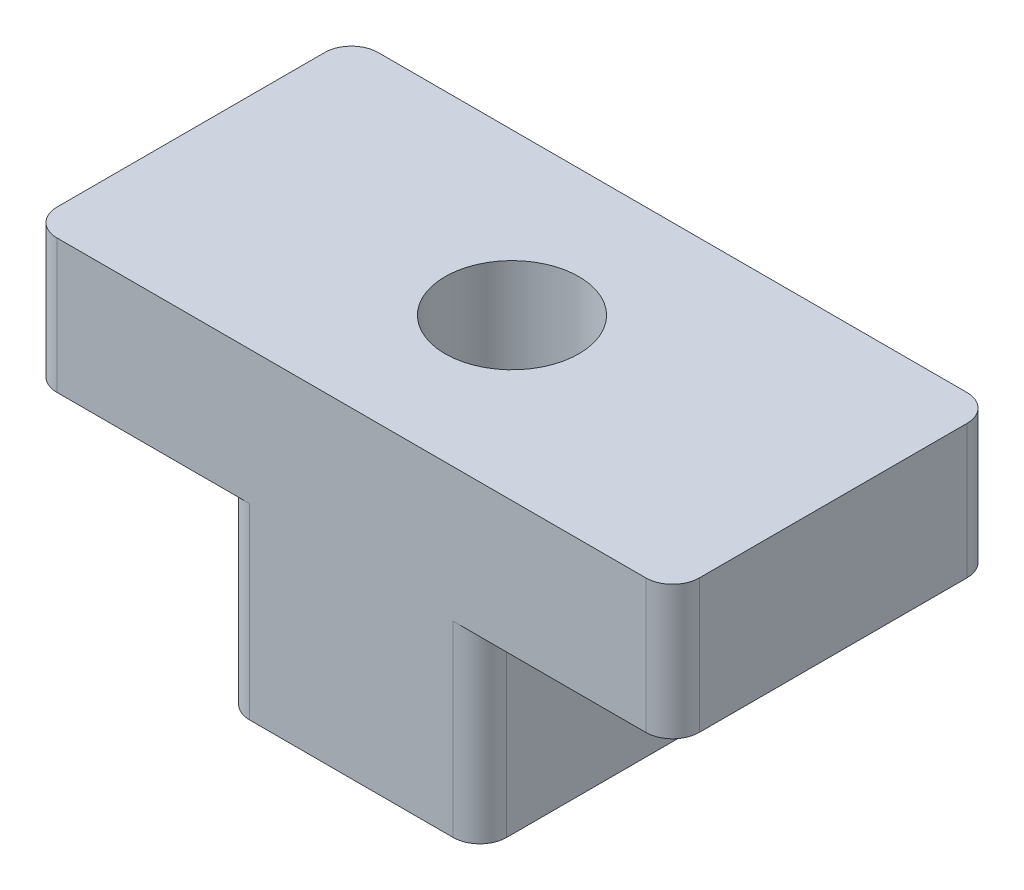
ISO-10303-21;
HEADER;
FILE_DESCRIPTION(('STEP AP214'),'2;1');
FILE_NAME('part.step','',(''),(''),'','','');
FILE_SCHEMA(('AUTOMOTIVE_DESIGN { 1 0 10303 214 1 1 1 1 }'));
ENDSEC;
DATA;
#1=APPLICATION_CONTEXT('core data for automotive mechanical design processes');
#2=APPLICATION_PROTOCOL_DEFINITION('international standard','automotive_design',2000,#1);
#3=PRODUCT_CONTEXT('',#1,'mechanical');
#4=PRODUCT('Part','Part','',(#3));
#5=PRODUCT_RELATED_PRODUCT_CATEGORY('part','',(#4));
#6=PRODUCT_DEFINITION_FORMATION('','',#4);
#7=PRODUCT_DEFINITION_CONTEXT('part definition',#1,'design');
#8=PRODUCT_DEFINITION('design','',#6,#7);
#9=PRODUCT_DEFINITION_SHAPE('','',#8);
#10=(LENGTH_UNIT() NAMED_UNIT(*) SI_UNIT(.MILLI.,.METRE.));
#11=(NAMED_UNIT(*) PLANE_ANGLE_UNIT() SI_UNIT($,.RADIAN.));
#12=(NAMED_UNIT(*) SI_UNIT($,.STERADIAN.) SOLID_ANGLE_UNIT());
#13=UNCERTAINTY_MEASURE_WITH_UNIT(LENGTH_MEASURE(1.E-05),#10,'distance_accuracy_value','');
#14=(GEOMETRIC_REPRESENTATION_CONTEXT(3) GLOBAL_UNCERTAINTY_ASSIGNED_CONTEXT((#13)) GLOBAL_UNIT_ASSIGNED_CONTEXT((#10,
#11,#12)) REPRESENTATION_CONTEXT('',''));
#15=CARTESIAN_POINT('',(0.,0.,0.));
#16=DIRECTION('',(0.,0.,1.));
#17=DIRECTION('',(1.,0.,0.));
#18=AXIS2_PLACEMENT_3D('',#15,#16,#17);
#19=CARTESIAN_POINT('',(6.,0.,3.));
#20=DIRECTION('',(-1.,0.,0.));
#21=DIRECTION('',(0.,0.,1.));
#22=AXIS2_PLACEMENT_3D('',#19,#20,#21);
#23=PLANE('',#22);
#24=DIRECTION('',(0.,0.,-1.));
#25=VECTOR('',#24,1.);
#26=CARTESIAN_POINT('',(6.,0.,3.));
#27=LINE('',#26,#25);
#28=CARTESIAN_POINT('',(6.,0.,2.5));
#29=VERTEX_POINT('',#28);
#30=CARTESIAN_POINT('',(6.,0.,-2.5));
#31=VERTEX_POINT('',#30);
#32=EDGE_CURVE('E184',#29,#31,#27,.T.);
#33=ORIENTED_EDGE('',*,*,#32,.T.);
#34=DIRECTION('',(0.,1.,0.));
#35=VECTOR('',#34,1.);
#36=CARTESIAN_POINT('',(6.,2.5,-2.5));
#37=LINE('',#36,#35);
#38=CARTESIAN_POINT('',(6.,2.5,-2.5));
#39=VERTEX_POINT('',#38);
#40=EDGE_CURVE('E274',#31,#39,#37,.T.);
#41=ORIENTED_EDGE('',*,*,#40,.T.);
#42=DIRECTION('',(0.,0.,-1.));
#43=VECTOR('',#42,1.);
#44=CARTESIAN_POINT('',(6.,2.5,3.));
#45=LINE('',#44,#43);
#46=CARTESIAN_POINT('',(6.,2.5,2.5));
#47=VERTEX_POINT('',#46);
#48=EDGE_CURVE('E190',#47,#39,#45,.T.);
#49=ORIENTED_EDGE('',*,*,#48,.F.);
#50=DIRECTION('',(0.,1.,0.));
#51=VECTOR('',#50,1.);
#52=CARTESIAN_POINT('',(6.,0.,2.5));
#53=LINE('',#52,#51);
#54=EDGE_CURVE('E70',#47,#29,#53,.F.);
#55=ORIENTED_EDGE('',*,*,#54,.T.);
#56=EDGE_LOOP('',(#33,#41,#49,#55));
#57=FACE_BOUND('',#56,.T.);
#58=ADVANCED_FACE('F47',(#57),#23,.F.);
#59=CARTESIAN_POINT('',(-6.,2.5,3.));
#60=DIRECTION('',(0.,-1.,0.));
#61=DIRECTION('',(0.,0.,-1.));
#62=AXIS2_PLACEMENT_3D('',#59,#60,#61);
#63=PLANE('',#62);
#64=CARTESIAN_POINT('',(0.,2.5,0.));
#65=DIRECTION('',(0.,1.,0.));
#66=DIRECTION('',(0.,0.,1.));
#67=AXIS2_PLACEMENT_3D('',#64,#65,#66);
#68=CIRCLE('',#67,1.25);
#69=CARTESIAN_POINT('',(0.,2.5,1.25));
#70=VERTEX_POINT('',#69);
#71=EDGE_CURVE('E366',#70,#70,#68,.T.);
#72=ORIENTED_EDGE('',*,*,#71,.F.);
#73=EDGE_LOOP('',(#72));
#74=FACE_BOUND('',#73,.T.);
#75=DIRECTION('',(0.,0.,-1.));
#76=VECTOR('',#75,1.);
#77=CARTESIAN_POINT('',(-6.,2.5,3.));
#78=LINE('',#77,#76);
#79=CARTESIAN_POINT('',(-6.,2.5,2.5));
#80=VERTEX_POINT('',#79);
#81=CARTESIAN_POINT('',(-6.,2.5,-2.5));
#82=VERTEX_POINT('',#81);
#83=EDGE_CURVE('E199',#80,#82,#78,.T.);
#84=ORIENTED_EDGE('',*,*,#83,.F.);
#85=CARTESIAN_POINT('',(-5.5,2.5,2.5));
#86=DIRECTION('',(0.,-1.,0.));
#87=DIRECTION('',(0.,0.,-1.));
#88=AXIS2_PLACEMENT_3D('',#85,#86,#87);
#89=CIRCLE('',#88,0.5);
#90=CARTESIAN_POINT('',(-5.5,2.5,3.));
#91=VERTEX_POINT('',#90);
#92=EDGE_CURVE('E269',#80,#91,#89,.F.);
#93=ORIENTED_EDGE('',*,*,#92,.T.);
#94=DIRECTION('',(-1.,0.,0.));
#95=VECTOR('',#94,1.);
#96=CARTESIAN_POINT('',(-6.,2.5,3.));
#97=LINE('',#96,#95);
#98=CARTESIAN_POINT('',(5.5,2.5,3.));
#99=VERTEX_POINT('',#98);
#100=EDGE_CURVE('E327',#99,#91,#97,.T.);
#101=ORIENTED_EDGE('',*,*,#100,.F.);
#102=CARTESIAN_POINT('',(5.5,2.5,2.5));
#103=DIRECTION('',(0.,-1.,0.));
#104=DIRECTION('',(0.,0.,-1.));
#105=AXIS2_PLACEMENT_3D('',#102,#103,#104);
#106=CIRCLE('',#105,0.5);
#107=EDGE_CURVE('E260',#99,#47,#106,.F.);
#108=ORIENTED_EDGE('',*,*,#107,.T.);
#109=ORIENTED_EDGE('',*,*,#48,.T.);
#110=CARTESIAN_POINT('',(5.5,2.5,-2.5));
#111=DIRECTION('',(0.,-1.,0.));
#112=DIRECTION('',(0.,0.,-1.));
#113=AXIS2_PLACEMENT_3D('',#110,#111,#112);
#114=CIRCLE('',#113,0.5);
#115=CARTESIAN_POINT('',(5.5,2.5,-3.));
#116=VERTEX_POINT('',#115);
#117=EDGE_CURVE('E263',#39,#116,#114,.F.);
#118=ORIENTED_EDGE('',*,*,#117,.T.);
#119=DIRECTION('',(-1.,0.,0.));
#120=VECTOR('',#119,1.);
#121=CARTESIAN_POINT('',(-6.,2.5,-3.));
#122=LINE('',#121,#120);
#123=CARTESIAN_POINT('',(-5.5,2.5,-3.));
#124=VERTEX_POINT('',#123);
#125=EDGE_CURVE('E330',#116,#124,#122,.T.);
#126=ORIENTED_EDGE('',*,*,#125,.T.);
#127=CARTESIAN_POINT('',(-5.5,2.5,-2.5));
#128=DIRECTION('',(0.,-1.,0.));
#129=DIRECTION('',(0.,0.,-1.));
#130=AXIS2_PLACEMENT_3D('',#127,#128,#129);
#131=CIRCLE('',#130,0.5);
#132=EDGE_CURVE('E266',#124,#82,#131,.F.);
#133=ORIENTED_EDGE('',*,*,#132,.T.);
#134=EDGE_LOOP('',(#84,#93,#101,#108,#109,#118,#126,#133));
#135=FACE_BOUND('',#134,.T.);
#136=ADVANCED_FACE('F360',(#74,#135),#63,.F.);
#137=CARTESIAN_POINT('',(-6.,0.,3.));
#138=DIRECTION('',(1.,0.,0.));
#139=DIRECTION('',(0.,0.,-1.));
#140=AXIS2_PLACEMENT_3D('',#137,#138,#139);
#141=PLANE('',#140);
#142=DIRECTION('',(0.,0.,-1.));
#143=VECTOR('',#142,1.);
#144=CARTESIAN_POINT('',(-6.,0.,3.));
#145=LINE('',#144,#143);
#146=CARTESIAN_POINT('',(-6.,0.,2.5));
#147=VERTEX_POINT('',#146);
#148=CARTESIAN_POINT('',(-6.,0.,-2.5));
#149=VERTEX_POINT('',#148);
#150=EDGE_CURVE('E308',#147,#149,#145,.T.);
#151=ORIENTED_EDGE('',*,*,#150,.F.);
#152=DIRECTION('',(0.,-1.,0.));
#153=VECTOR('',#152,1.);
#154=CARTESIAN_POINT('',(-6.,0.,2.5));
#155=LINE('',#154,#153);
#156=EDGE_CURVE('E257',#147,#80,#155,.F.);
#157=ORIENTED_EDGE('',*,*,#156,.T.);
#158=ORIENTED_EDGE('',*,*,#83,.T.);
#159=DIRECTION('',(0.,-1.,0.));
#160=VECTOR('',#159,1.);
#161=CARTESIAN_POINT('',(-6.,0.,-2.5));
#162=LINE('',#161,#160);
#163=EDGE_CURVE('E254',#82,#149,#162,.T.);
#164=ORIENTED_EDGE('',*,*,#163,.T.);
#165=EDGE_LOOP('',(#151,#157,#158,#164));
#166=FACE_BOUND('',#165,.T.);
#167=ADVANCED_FACE('F349',(#166),#141,.F.);
#168=CARTESIAN_POINT('',(-6.,0.,3.));
#169=DIRECTION('',(0.,1.,0.));
#170=DIRECTION('',(-1.,0.,0.));
#171=AXIS2_PLACEMENT_3D('',#168,#169,#170);
#172=PLANE('',#171);
#173=DIRECTION('',(1.,0.,0.));
#174=VECTOR('',#173,1.);
#175=CARTESIAN_POINT('',(-6.,0.,3.));
#176=LINE('',#175,#174);
#177=CARTESIAN_POINT('',(-5.5,0.,3.));
#178=VERTEX_POINT('',#177);
#179=CARTESIAN_POINT('',(-1.9,0.,3.));
#180=VERTEX_POINT('',#179);
#181=EDGE_CURVE('E374',#178,#180,#176,.T.);
#182=ORIENTED_EDGE('',*,*,#181,.F.);
#183=CARTESIAN_POINT('',(-5.5,0.,2.5));
#184=DIRECTION('',(0.,1.,0.));
#185=DIRECTION('',(-1.,0.,0.));
#186=AXIS2_PLACEMENT_3D('',#183,#184,#185);
#187=CIRCLE('',#186,0.5);
#188=EDGE_CURVE('E251',#178,#147,#187,.F.);
#189=ORIENTED_EDGE('',*,*,#188,.T.);
#190=ORIENTED_EDGE('',*,*,#150,.T.);
#191=CARTESIAN_POINT('',(-5.5,0.,-2.5));
#192=DIRECTION('',(0.,1.,0.));
#193=DIRECTION('',(-1.,0.,0.));
#194=AXIS2_PLACEMENT_3D('',#191,#192,#193);
#195=CIRCLE('',#194,0.5);
#196=CARTESIAN_POINT('',(-5.5,0.,-3.));
#197=VERTEX_POINT('',#196);
#198=EDGE_CURVE('E248',#149,#197,#195,.F.);
#199=ORIENTED_EDGE('',*,*,#198,.T.);
#200=DIRECTION('',(1.,0.,0.));
#201=VECTOR('',#200,1.);
#202=CARTESIAN_POINT('',(-6.,0.,-3.));
#203=LINE('',#202,#201);
#204=CARTESIAN_POINT('',(-1.9,0.,-3.));
#205=VERTEX_POINT('',#204);
#206=EDGE_CURVE('E298',#197,#205,#203,.T.);
#207=ORIENTED_EDGE('',*,*,#206,.T.);
#208=CARTESIAN_POINT('',(-1.9,0.,-2.5));
#209=DIRECTION('',(0.,1.,0.));
#210=DIRECTION('',(-1.,0.,0.));
#211=AXIS2_PLACEMENT_3D('',#208,#209,#210);
#212=CIRCLE('',#211,0.5);
#213=CARTESIAN_POINT('',(-2.4,0.,-2.5));
#214=VERTEX_POINT('',#213);
#215=EDGE_CURVE('E173',#205,#214,#212,.T.);
#216=ORIENTED_EDGE('',*,*,#215,.T.);
#217=DIRECTION('',(0.,0.,-1.));
#218=VECTOR('',#217,1.);
#219=CARTESIAN_POINT('',(-2.4,0.,3.));
#220=LINE('',#219,#218);
#221=CARTESIAN_POINT('',(-2.4,0.,2.5));
#222=VERTEX_POINT('',#221);
#223=EDGE_CURVE('E295',#222,#214,#220,.T.);
#224=ORIENTED_EDGE('',*,*,#223,.F.);
#225=CARTESIAN_POINT('',(-1.9,0.,2.5));
#226=DIRECTION('',(0.,1.,0.));
#227=DIRECTION('',(-1.,0.,0.));
#228=AXIS2_PLACEMENT_3D('',#225,#226,#227);
#229=CIRCLE('',#228,0.5);
#230=EDGE_CURVE('E11',#222,#180,#229,.T.);
#231=ORIENTED_EDGE('',*,*,#230,.T.);
#232=EDGE_LOOP('',(#182,#189,#190,#199,#207,#216,#224,#231));
#233=FACE_BOUND('',#232,.T.);
#234=ADVANCED_FACE('F294',(#233),#172,.F.);
#235=CARTESIAN_POINT('',(-2.4,0.,3.));
#236=DIRECTION('',(1.,0.,0.));
#237=DIRECTION('',(0.,1.,0.));
#238=AXIS2_PLACEMENT_3D('',#235,#236,#237);
#239=PLANE('',#238);
#240=ORIENTED_EDGE('',*,*,#223,.T.);
#241=DIRECTION('',(0.,-1.,0.));
#242=VECTOR('',#241,1.);
#243=CARTESIAN_POINT('',(-2.4,-3.5,-2.5));
#244=LINE('',#243,#242);
#245=CARTESIAN_POINT('',(-2.4,-3.5,-2.5));
#246=VERTEX_POINT('',#245);
#247=EDGE_CURVE('E229',#214,#246,#244,.T.);
#248=ORIENTED_EDGE('',*,*,#247,.T.);
#249=DIRECTION('',(0.,0.,-1.));
#250=VECTOR('',#249,1.);
#251=CARTESIAN_POINT('',(-2.4,-3.5,3.));
#252=LINE('',#251,#250);
#253=CARTESIAN_POINT('',(-2.4,-3.5,2.5));
#254=VERTEX_POINT('',#253);
#255=EDGE_CURVE('E309',#254,#246,#252,.T.);
#256=ORIENTED_EDGE('',*,*,#255,.F.);
#257=DIRECTION('',(0.,-1.,0.));
#258=VECTOR('',#257,1.);
#259=CARTESIAN_POINT('',(-2.4,0.,2.5));
#260=LINE('',#259,#258);
#261=EDGE_CURVE('E226',#254,#222,#260,.F.);
#262=ORIENTED_EDGE('',*,*,#261,.T.);
#263=EDGE_LOOP('',(#240,#248,#256,#262));
#264=FACE_BOUND('',#263,.T.);
#265=ADVANCED_FACE('F303',(#264),#239,.F.);
#266=CARTESIAN_POINT('',(-2.4,-3.5,3.));
#267=DIRECTION('',(0.,1.,0.));
#268=DIRECTION('',(-1.,0.,0.));
#269=AXIS2_PLACEMENT_3D('',#266,#267,#268);
#270=PLANE('',#269);
#271=CARTESIAN_POINT('',(0.,-3.5,0.));
#272=DIRECTION('',(0.,1.,0.));
#273=DIRECTION('',(0.,0.,1.));
#274=AXIS2_PLACEMENT_3D('',#271,#272,#273);
#275=CIRCLE('',#274,1.25);
#276=CARTESIAN_POINT('',(0.,-3.5,1.25));
#277=VERTEX_POINT('',#276);
#278=EDGE_CURVE('E362',#277,#277,#275,.T.);
#279=ORIENTED_EDGE('',*,*,#278,.T.);
#280=EDGE_LOOP('',(#279));
#281=FACE_BOUND('',#280,.T.);
#282=DIRECTION('',(1.,0.,0.));
#283=VECTOR('',#282,1.);
#284=CARTESIAN_POINT('',(-2.4,-3.5,-3.));
#285=LINE('',#284,#283);
#286=CARTESIAN_POINT('',(-1.9,-3.5,-3.));
#287=VERTEX_POINT('',#286);
#288=CARTESIAN_POINT('',(1.9,-3.5,-3.));
#289=VERTEX_POINT('',#288);
#290=EDGE_CURVE('E316',#287,#289,#285,.T.);
#291=ORIENTED_EDGE('',*,*,#290,.T.);
#292=CARTESIAN_POINT('',(1.9,-3.5,-2.5));
#293=DIRECTION('',(0.,1.,0.));
#294=DIRECTION('',(-1.,0.,0.));
#295=AXIS2_PLACEMENT_3D('',#292,#293,#294);
#296=CIRCLE('',#295,0.5);
#297=CARTESIAN_POINT('',(2.4,-3.5,-2.5));
#298=VERTEX_POINT('',#297);
#299=EDGE_CURVE('E223',#289,#298,#296,.F.);
#300=ORIENTED_EDGE('',*,*,#299,.T.);
#301=DIRECTION('',(0.,0.,-1.));
#302=VECTOR('',#301,1.);
#303=CARTESIAN_POINT('',(2.4,-3.5,3.));
#304=LINE('',#303,#302);
#305=CARTESIAN_POINT('',(2.4,-3.5,2.5));
#306=VERTEX_POINT('',#305);
#307=EDGE_CURVE('E183',#306,#298,#304,.T.);
#308=ORIENTED_EDGE('',*,*,#307,.F.);
#309=CARTESIAN_POINT('',(1.9,-3.5,2.5));
#310=DIRECTION('',(0.,1.,0.));
#311=DIRECTION('',(-1.,0.,0.));
#312=AXIS2_PLACEMENT_3D('',#309,#310,#311);
#313=CIRCLE('',#312,0.5);
#314=CARTESIAN_POINT('',(1.9,-3.5,3.));
#315=VERTEX_POINT('',#314);
#316=EDGE_CURVE('E188',#306,#315,#313,.F.);
#317=ORIENTED_EDGE('',*,*,#316,.T.);
#318=DIRECTION('',(1.,0.,0.));
#319=VECTOR('',#318,1.);
#320=CARTESIAN_POINT('',(-2.4,-3.5,3.));
#321=LINE('',#320,#319);
#322=CARTESIAN_POINT('',(-1.9,-3.5,3.));
#323=VERTEX_POINT('',#322);
#324=EDGE_CURVE('E371',#323,#315,#321,.T.);
#325=ORIENTED_EDGE('',*,*,#324,.F.);
#326=CARTESIAN_POINT('',(-1.9,-3.5,2.5));
#327=DIRECTION('',(0.,1.,0.));
#328=DIRECTION('',(-1.,0.,0.));
#329=AXIS2_PLACEMENT_3D('',#326,#327,#328);
#330=CIRCLE('',#329,0.5);
#331=EDGE_CURVE('E215',#323,#254,#330,.F.);
#332=ORIENTED_EDGE('',*,*,#331,.T.);
#333=ORIENTED_EDGE('',*,*,#255,.T.);
#334=CARTESIAN_POINT('',(-1.9,-3.5,-2.5));
#335=DIRECTION('',(0.,1.,0.));
#336=DIRECTION('',(-1.,0.,0.));
#337=AXIS2_PLACEMENT_3D('',#334,#335,#336);
#338=CIRCLE('',#337,0.5);
#339=EDGE_CURVE('E220',#246,#287,#338,.F.);
#340=ORIENTED_EDGE('',*,*,#339,.T.);
#341=EDGE_LOOP('',(#291,#300,#308,#317,#325,#332,#333,#340));
#342=FACE_BOUND('',#341,.T.);
#343=ADVANCED_FACE('F315',(#281,#342),#270,.F.);
#344=CARTESIAN_POINT('',(2.4,0.,3.));
#345=DIRECTION('',(-1.,0.,0.));
#346=DIRECTION('',(0.,-1.,0.));
#347=AXIS2_PLACEMENT_3D('',#344,#345,#346);
#348=PLANE('',#347);
#349=ORIENTED_EDGE('',*,*,#307,.T.);
#350=DIRECTION('',(0.,1.,0.));
#351=VECTOR('',#350,1.);
#352=CARTESIAN_POINT('',(2.4,0.,-2.5));
#353=LINE('',#352,#351);
#354=CARTESIAN_POINT('',(2.4,0.,-2.5));
#355=VERTEX_POINT('',#354);
#356=EDGE_CURVE('E181',#298,#355,#353,.T.);
#357=ORIENTED_EDGE('',*,*,#356,.T.);
#358=DIRECTION('',(0.,0.,-1.));
#359=VECTOR('',#358,1.);
#360=CARTESIAN_POINT('',(2.4,0.,3.));
#361=LINE('',#360,#359);
#362=CARTESIAN_POINT('',(2.4,0.,2.5));
#363=VERTEX_POINT('',#362);
#364=EDGE_CURVE('E165',#363,#355,#361,.T.);
#365=ORIENTED_EDGE('',*,*,#364,.F.);
#366=DIRECTION('',(0.,1.,0.));
#367=VECTOR('',#366,1.);
#368=CARTESIAN_POINT('',(2.4,0.,2.5));
#369=LINE('',#368,#367);
#370=EDGE_CURVE('E178',#363,#306,#369,.F.);
#371=ORIENTED_EDGE('',*,*,#370,.T.);
#372=EDGE_LOOP('',(#349,#357,#365,#371));
#373=FACE_BOUND('',#372,.T.);
#374=ADVANCED_FACE('F177',(#373),#348,.F.);
#375=CARTESIAN_POINT('',(6.,0.,3.));
#376=DIRECTION('',(0.,1.,0.));
#377=DIRECTION('',(-1.,0.,0.));
#378=AXIS2_PLACEMENT_3D('',#375,#376,#377);
#379=PLANE('',#378);
#380=DIRECTION('',(1.,0.,0.));
#381=VECTOR('',#380,1.);
#382=CARTESIAN_POINT('',(6.,0.,-3.));
#383=LINE('',#382,#381);
#384=CARTESIAN_POINT('',(1.9,0.,-3.));
#385=VERTEX_POINT('',#384);
#386=CARTESIAN_POINT('',(5.5,0.,-3.));
#387=VERTEX_POINT('',#386);
#388=EDGE_CURVE('E322',#385,#387,#383,.T.);
#389=ORIENTED_EDGE('',*,*,#388,.T.);
#390=CARTESIAN_POINT('',(5.5,0.,-2.5));
#391=DIRECTION('',(0.,1.,0.));
#392=DIRECTION('',(-1.,0.,0.));
#393=AXIS2_PLACEMENT_3D('',#390,#391,#392);
#394=CIRCLE('',#393,0.5);
#395=EDGE_CURVE('E63',#387,#31,#394,.F.);
#396=ORIENTED_EDGE('',*,*,#395,.T.);
#397=ORIENTED_EDGE('',*,*,#32,.F.);
#398=CARTESIAN_POINT('',(5.5,0.,2.5));
#399=DIRECTION('',(0.,1.,0.));
#400=DIRECTION('',(-1.,0.,0.));
#401=AXIS2_PLACEMENT_3D('',#398,#399,#400);
#402=CIRCLE('',#401,0.5);
#403=CARTESIAN_POINT('',(5.5,0.,3.));
#404=VERTEX_POINT('',#403);
#405=EDGE_CURVE('E278',#29,#404,#402,.F.);
#406=ORIENTED_EDGE('',*,*,#405,.T.);
#407=DIRECTION('',(1.,0.,0.));
#408=VECTOR('',#407,1.);
#409=CARTESIAN_POINT('',(6.,0.,3.));
#410=LINE('',#409,#408);
#411=CARTESIAN_POINT('',(1.9,0.,3.));
#412=VERTEX_POINT('',#411);
#413=EDGE_CURVE('E167',#412,#404,#410,.T.);
#414=ORIENTED_EDGE('',*,*,#413,.F.);
#415=CARTESIAN_POINT('',(1.9,0.,2.5));
#416=DIRECTION('',(0.,1.,0.));
#417=DIRECTION('',(-1.,0.,0.));
#418=AXIS2_PLACEMENT_3D('',#415,#416,#417);
#419=CIRCLE('',#418,0.5);
#420=EDGE_CURVE('E56',#412,#363,#419,.T.);
#421=ORIENTED_EDGE('',*,*,#420,.T.);
#422=ORIENTED_EDGE('',*,*,#364,.T.);
#423=CARTESIAN_POINT('',(1.9,0.,-2.5));
#424=DIRECTION('',(0.,1.,0.));
#425=DIRECTION('',(-1.,0.,0.));
#426=AXIS2_PLACEMENT_3D('',#423,#424,#425);
#427=CIRCLE('',#426,0.5);
#428=EDGE_CURVE('E283',#355,#385,#427,.T.);
#429=ORIENTED_EDGE('',*,*,#428,.T.);
#430=EDGE_LOOP('',(#389,#396,#397,#406,#414,#421,#422,#429));
#431=FACE_BOUND('',#430,.T.);
#432=ADVANCED_FACE('F163',(#431),#379,.F.);
#433=CARTESIAN_POINT('',(0.,0.,3.));
#434=DIRECTION('',(0.,0.,-1.));
#435=DIRECTION('',(-1.,0.,0.));
#436=AXIS2_PLACEMENT_3D('',#433,#434,#435);
#437=PLANE('',#436);
#438=ORIENTED_EDGE('',*,*,#324,.T.);
#439=DIRECTION('',(0.,1.,0.));
#440=VECTOR('',#439,1.);
#441=CARTESIAN_POINT('',(1.9,0.,3.));
#442=LINE('',#441,#440);
#443=EDGE_CURVE('E245',#315,#412,#442,.T.);
#444=ORIENTED_EDGE('',*,*,#443,.T.);
#445=ORIENTED_EDGE('',*,*,#413,.T.);
#446=DIRECTION('',(0.,1.,0.));
#447=VECTOR('',#446,1.);
#448=CARTESIAN_POINT('',(5.5,0.,3.));
#449=LINE('',#448,#447);
#450=EDGE_CURVE('E233',#404,#99,#449,.T.);
#451=ORIENTED_EDGE('',*,*,#450,.T.);
#452=ORIENTED_EDGE('',*,*,#100,.T.);
#453=DIRECTION('',(0.,-1.,0.));
#454=VECTOR('',#453,1.);
#455=CARTESIAN_POINT('',(-5.5,0.,3.));
#456=LINE('',#455,#454);
#457=EDGE_CURVE('E237',#91,#178,#456,.T.);
#458=ORIENTED_EDGE('',*,*,#457,.T.);
#459=ORIENTED_EDGE('',*,*,#181,.T.);
#460=DIRECTION('',(0.,-1.,0.));
#461=VECTOR('',#460,1.);
#462=CARTESIAN_POINT('',(-1.9,0.,3.));
#463=LINE('',#462,#461);
#464=EDGE_CURVE('E241',#180,#323,#463,.T.);
#465=ORIENTED_EDGE('',*,*,#464,.T.);
#466=EDGE_LOOP('',(#438,#444,#445,#451,#452,#458,#459,#465));
#467=FACE_BOUND('',#466,.T.);
#468=ADVANCED_FACE('F425',(#467),#437,.F.);
#469=CARTESIAN_POINT('',(0.,0.,-3.));
#470=DIRECTION('',(0.,0.,-1.));
#471=DIRECTION('',(-1.,0.,0.));
#472=AXIS2_PLACEMENT_3D('',#469,#470,#471);
#473=PLANE('',#472);
#474=ORIENTED_EDGE('',*,*,#388,.F.);
#475=DIRECTION('',(0.,1.,0.));
#476=VECTOR('',#475,1.);
#477=CARTESIAN_POINT('',(1.9,-3.5,-3.));
#478=LINE('',#477,#476);
#479=EDGE_CURVE('E212',#385,#289,#478,.F.);
#480=ORIENTED_EDGE('',*,*,#479,.T.);
#481=ORIENTED_EDGE('',*,*,#290,.F.);
#482=DIRECTION('',(0.,-1.,0.));
#483=VECTOR('',#482,1.);
#484=CARTESIAN_POINT('',(-1.9,0.,-3.));
#485=LINE('',#484,#483);
#486=EDGE_CURVE('E208',#287,#205,#485,.F.);
#487=ORIENTED_EDGE('',*,*,#486,.T.);
#488=ORIENTED_EDGE('',*,*,#206,.F.);
#489=DIRECTION('',(0.,-1.,0.));
#490=VECTOR('',#489,1.);
#491=CARTESIAN_POINT('',(-5.5,2.5,-3.));
#492=LINE('',#491,#490);
#493=EDGE_CURVE('E205',#197,#124,#492,.F.);
#494=ORIENTED_EDGE('',*,*,#493,.T.);
#495=ORIENTED_EDGE('',*,*,#125,.F.);
#496=DIRECTION('',(0.,1.,0.));
#497=VECTOR('',#496,1.);
#498=CARTESIAN_POINT('',(5.5,0.,-3.));
#499=LINE('',#498,#497);
#500=EDGE_CURVE('E195',#116,#387,#499,.F.);
#501=ORIENTED_EDGE('',*,*,#500,.T.);
#502=EDGE_LOOP('',(#474,#480,#481,#487,#488,#494,#495,#501));
#503=FACE_BOUND('',#502,.T.);
#504=ADVANCED_FACE('F319',(#503),#473,.T.);
#505=CARTESIAN_POINT('',(0.,-3.5,0.));
#506=DIRECTION('',(0.,1.,0.));
#507=DIRECTION('',(0.,0.,1.));
#508=AXIS2_PLACEMENT_3D('',#505,#506,#507);
#509=CYLINDRICAL_SURFACE('',#508,1.25);
#510=ORIENTED_EDGE('',*,*,#278,.F.);
#511=EDGE_LOOP('',(#510));
#512=FACE_BOUND('',#511,.T.);
#513=ORIENTED_EDGE('',*,*,#71,.T.);
#514=EDGE_LOOP('',(#513));
#515=FACE_BOUND('',#514,.T.);
#516=ADVANCED_FACE('F384',(#512,#515),#509,.F.);
#517=CARTESIAN_POINT('',(1.9,0.,-2.5));
#518=DIRECTION('',(0.,-1.,0.));
#519=DIRECTION('',(1.,0.,0.));
#520=AXIS2_PLACEMENT_3D('',#517,#518,#519);
#521=CYLINDRICAL_SURFACE('',#520,0.5);
#522=ORIENTED_EDGE('',*,*,#299,.F.);
#523=ORIENTED_EDGE('',*,*,#479,.F.);
#524=ORIENTED_EDGE('',*,*,#428,.F.);
#525=ORIENTED_EDGE('',*,*,#356,.F.);
#526=EDGE_LOOP('',(#522,#523,#524,#525));
#527=FACE_BOUND('',#526,.T.);
#528=ADVANCED_FACE('F396',(#527),#521,.T.);
#529=CARTESIAN_POINT('',(-1.9,0.,-2.5));
#530=DIRECTION('',(0.,1.,0.));
#531=DIRECTION('',(-1.,0.,0.));
#532=AXIS2_PLACEMENT_3D('',#529,#530,#531);
#533=CYLINDRICAL_SURFACE('',#532,0.5);
#534=ORIENTED_EDGE('',*,*,#215,.F.);
#535=ORIENTED_EDGE('',*,*,#486,.F.);
#536=ORIENTED_EDGE('',*,*,#339,.F.);
#537=ORIENTED_EDGE('',*,*,#247,.F.);
#538=EDGE_LOOP('',(#534,#535,#536,#537));
#539=FACE_BOUND('',#538,.T.);
#540=ADVANCED_FACE('F311',(#539),#533,.T.);
#541=CARTESIAN_POINT('',(1.9,0.,2.5));
#542=DIRECTION('',(0.,1.,0.));
#543=DIRECTION('',(-1.,0.,0.));
#544=AXIS2_PLACEMENT_3D('',#541,#542,#543);
#545=CYLINDRICAL_SURFACE('',#544,0.5);
#546=ORIENTED_EDGE('',*,*,#316,.F.);
#547=ORIENTED_EDGE('',*,*,#370,.F.);
#548=ORIENTED_EDGE('',*,*,#420,.F.);
#549=ORIENTED_EDGE('',*,*,#443,.F.);
#550=EDGE_LOOP('',(#546,#547,#548,#549));
#551=FACE_BOUND('',#550,.T.);
#552=ADVANCED_FACE('F187',(#551),#545,.T.);
#553=CARTESIAN_POINT('',(-1.9,0.,2.5));
#554=DIRECTION('',(0.,-1.,0.));
#555=DIRECTION('',(1.,0.,0.));
#556=AXIS2_PLACEMENT_3D('',#553,#554,#555);
#557=CYLINDRICAL_SURFACE('',#556,0.5);
#558=ORIENTED_EDGE('',*,*,#230,.F.);
#559=ORIENTED_EDGE('',*,*,#261,.F.);
#560=ORIENTED_EDGE('',*,*,#331,.F.);
#561=ORIENTED_EDGE('',*,*,#464,.F.);
#562=EDGE_LOOP('',(#558,#559,#560,#561));
#563=FACE_BOUND('',#562,.T.);
#564=ADVANCED_FACE('F404',(#563),#557,.T.);
#565=CARTESIAN_POINT('',(-5.5,0.,2.5));
#566=DIRECTION('',(0.,-1.,0.));
#567=DIRECTION('',(0.,0.,-1.));
#568=AXIS2_PLACEMENT_3D('',#565,#566,#567);
#569=CYLINDRICAL_SURFACE('',#568,0.5);
#570=ORIENTED_EDGE('',*,*,#92,.F.);
#571=ORIENTED_EDGE('',*,*,#156,.F.);
#572=ORIENTED_EDGE('',*,*,#188,.F.);
#573=ORIENTED_EDGE('',*,*,#457,.F.);
#574=EDGE_LOOP('',(#570,#571,#572,#573));
#575=FACE_BOUND('',#574,.T.);
#576=ADVANCED_FACE('F407',(#575),#569,.T.);
#577=CARTESIAN_POINT('',(-5.5,0.,-2.5));
#578=DIRECTION('',(0.,1.,0.));
#579=DIRECTION('',(0.,0.,1.));
#580=AXIS2_PLACEMENT_3D('',#577,#578,#579);
#581=CYLINDRICAL_SURFACE('',#580,0.5);
#582=ORIENTED_EDGE('',*,*,#132,.F.);
#583=ORIENTED_EDGE('',*,*,#493,.F.);
#584=ORIENTED_EDGE('',*,*,#198,.F.);
#585=ORIENTED_EDGE('',*,*,#163,.F.);
#586=EDGE_LOOP('',(#582,#583,#584,#585));
#587=FACE_BOUND('',#586,.T.);
#588=ADVANCED_FACE('F355',(#587),#581,.T.);
#589=CARTESIAN_POINT('',(5.5,0.,-2.5));
#590=DIRECTION('',(0.,-1.,0.));
#591=DIRECTION('',(0.,0.,-1.));
#592=AXIS2_PLACEMENT_3D('',#589,#590,#591);
#593=CYLINDRICAL_SURFACE('',#592,0.5);
#594=ORIENTED_EDGE('',*,*,#395,.F.);
#595=ORIENTED_EDGE('',*,*,#500,.F.);
#596=ORIENTED_EDGE('',*,*,#117,.F.);
#597=ORIENTED_EDGE('',*,*,#40,.F.);
#598=EDGE_LOOP('',(#594,#595,#596,#597));
#599=FACE_BOUND('',#598,.T.);
#600=ADVANCED_FACE('F413',(#599),#593,.T.);
#601=CARTESIAN_POINT('',(5.5,0.,2.5));
#602=DIRECTION('',(0.,1.,0.));
#603=DIRECTION('',(0.,0.,1.));
#604=AXIS2_PLACEMENT_3D('',#601,#602,#603);
#605=CYLINDRICAL_SURFACE('',#604,0.5);
#606=ORIENTED_EDGE('',*,*,#405,.F.);
#607=ORIENTED_EDGE('',*,*,#54,.F.);
#608=ORIENTED_EDGE('',*,*,#107,.F.);
#609=ORIENTED_EDGE('',*,*,#450,.F.);
#610=EDGE_LOOP('',(#606,#607,#608,#609));
#611=FACE_BOUND('',#610,.T.);
#612=ADVANCED_FACE('F49',(#611),#605,.T.);
#613=CLOSED_SHELL('',(#58,#136,#167,#234,#265,#343,#374,#432,#468,#504,#516,#528,#540,#552,#564,
#576,#588,#600,#612));
#614=MANIFOLD_SOLID_BREP('B2',#613);
#615=ADVANCED_BREP_SHAPE_REPRESENTATION('',(#18,#614),#14);
#616=SHAPE_DEFINITION_REPRESENTATION(#9,#615);
ENDSEC;
END-ISO-10303-21;
